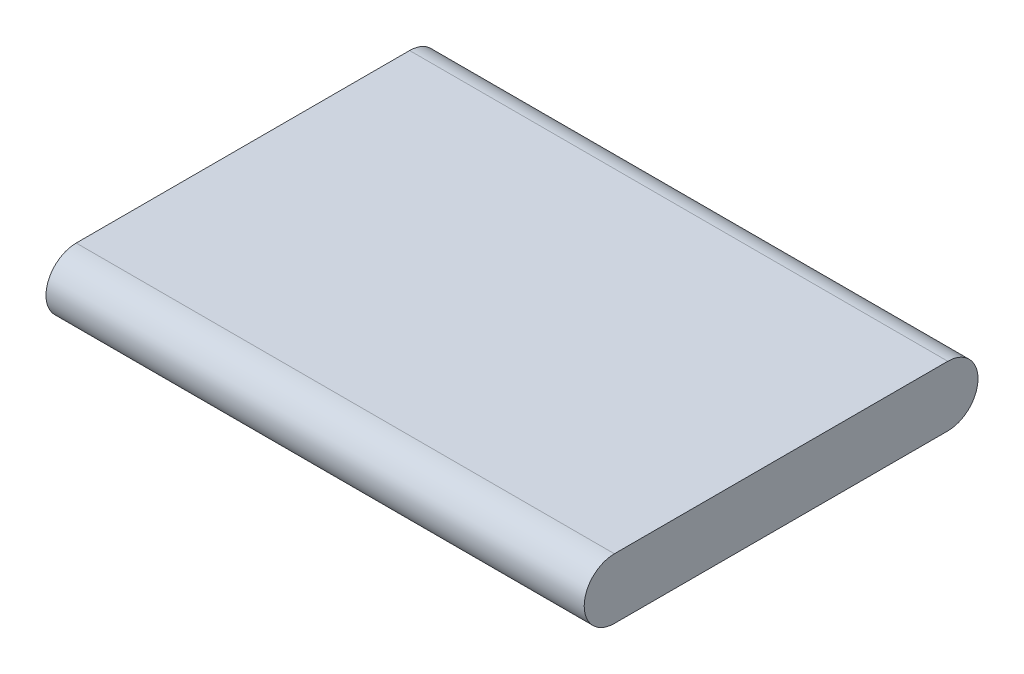
ISO-10303-21;
HEADER;
FILE_DESCRIPTION(('STEP AP214'),'2;1');
FILE_NAME('part.step','',(''),(''),'','','');
FILE_SCHEMA(('AUTOMOTIVE_DESIGN { 1 0 10303 214 1 1 1 1 }'));
ENDSEC;
DATA;
#1=APPLICATION_CONTEXT('core data for automotive mechanical design processes');
#2=APPLICATION_PROTOCOL_DEFINITION('international standard','automotive_design',2000,#1);
#3=PRODUCT_CONTEXT('',#1,'mechanical');
#4=PRODUCT('Part','Part','',(#3));
#5=PRODUCT_RELATED_PRODUCT_CATEGORY('part','',(#4));
#6=PRODUCT_DEFINITION_FORMATION('','',#4);
#7=PRODUCT_DEFINITION_CONTEXT('part definition',#1,'design');
#8=PRODUCT_DEFINITION('design','',#6,#7);
#9=PRODUCT_DEFINITION_SHAPE('','',#8);
#10=(LENGTH_UNIT() NAMED_UNIT(*) SI_UNIT(.MILLI.,.METRE.));
#11=(NAMED_UNIT(*) PLANE_ANGLE_UNIT() SI_UNIT($,.RADIAN.));
#12=(NAMED_UNIT(*) SI_UNIT($,.STERADIAN.) SOLID_ANGLE_UNIT());
#13=UNCERTAINTY_MEASURE_WITH_UNIT(LENGTH_MEASURE(1.E-05),#10,'distance_accuracy_value','');
#14=(GEOMETRIC_REPRESENTATION_CONTEXT(3) GLOBAL_UNCERTAINTY_ASSIGNED_CONTEXT((#13)) GLOBAL_UNIT_ASSIGNED_CONTEXT((#10,
#11,#12)) REPRESENTATION_CONTEXT('',''));
#15=CARTESIAN_POINT('',(0.,0.,0.));
#16=DIRECTION('',(0.,0.,1.));
#17=DIRECTION('',(1.,0.,0.));
#18=AXIS2_PLACEMENT_3D('',#15,#16,#17);
#19=CARTESIAN_POINT('',(41.,0.,10.8135444842036));
#20=DIRECTION('',(-1.,0.,0.));
#21=DIRECTION('',(0.,0.,1.));
#22=AXIS2_PLACEMENT_3D('',#19,#20,#21);
#23=CYLINDRICAL_SURFACE('',#22,2.3);
#24=CARTESIAN_POINT('',(0.,0.,10.8135444842036));
#25=DIRECTION('',(1.,0.,0.));
#26=DIRECTION('',(0.,0.,-1.));
#27=AXIS2_PLACEMENT_3D('',#24,#25,#26);
#28=CIRCLE('',#27,2.3);
#29=CARTESIAN_POINT('',(0.,2.3,10.8135444842036));
#30=VERTEX_POINT('',#29);
#31=CARTESIAN_POINT('',(0.,-2.3,10.8135444842036));
#32=VERTEX_POINT('',#31);
#33=EDGE_CURVE('E96',#30,#32,#28,.T.);
#34=ORIENTED_EDGE('',*,*,#33,.T.);
#35=DIRECTION('',(-1.,0.,0.));
#36=VECTOR('',#35,1.);
#37=CARTESIAN_POINT('',(41.,-2.3,10.8135444842036));
#38=LINE('',#37,#36);
#39=CARTESIAN_POINT('',(41.,-2.3,10.8135444842036));
#40=VERTEX_POINT('',#39);
#41=EDGE_CURVE('E11',#40,#32,#38,.T.);
#42=ORIENTED_EDGE('',*,*,#41,.F.);
#43=CARTESIAN_POINT('',(41.,0.,10.8135444842036));
#44=DIRECTION('',(1.,0.,0.));
#45=DIRECTION('',(0.,0.,-1.));
#46=AXIS2_PLACEMENT_3D('',#43,#44,#45);
#47=CIRCLE('',#46,2.3);
#48=CARTESIAN_POINT('',(41.,2.3,10.8135444842036));
#49=VERTEX_POINT('',#48);
#50=EDGE_CURVE('E84',#49,#40,#47,.T.);
#51=ORIENTED_EDGE('',*,*,#50,.F.);
#52=DIRECTION('',(-1.,0.,0.));
#53=VECTOR('',#52,1.);
#54=CARTESIAN_POINT('',(41.,2.3,10.8135444842036));
#55=LINE('',#54,#53);
#56=EDGE_CURVE('E92',#49,#30,#55,.T.);
#57=ORIENTED_EDGE('',*,*,#56,.T.);
#58=EDGE_LOOP('',(#34,#42,#51,#57));
#59=FACE_BOUND('',#58,.T.);
#60=ADVANCED_FACE('F33',(#59),#23,.T.);
#61=CARTESIAN_POINT('',(41.,-2.3,10.8135444842036));
#62=DIRECTION('',(0.,1.,0.));
#63=DIRECTION('',(0.,0.,1.));
#64=AXIS2_PLACEMENT_3D('',#61,#62,#63);
#65=PLANE('',#64);
#66=DIRECTION('',(0.,0.,-1.));
#67=VECTOR('',#66,1.);
#68=CARTESIAN_POINT('',(0.,-2.3,10.8135444842036));
#69=LINE('',#68,#67);
#70=CARTESIAN_POINT('',(0.,-2.3,-14.5864555157964));
#71=VERTEX_POINT('',#70);
#72=EDGE_CURVE('E88',#32,#71,#69,.T.);
#73=ORIENTED_EDGE('',*,*,#72,.T.);
#74=DIRECTION('',(-1.,0.,0.));
#75=VECTOR('',#74,1.);
#76=CARTESIAN_POINT('',(41.,-2.3,-14.5864555157964));
#77=LINE('',#76,#75);
#78=CARTESIAN_POINT('',(41.,-2.3,-14.5864555157964));
#79=VERTEX_POINT('',#78);
#80=EDGE_CURVE('E41',#79,#71,#77,.T.);
#81=ORIENTED_EDGE('',*,*,#80,.F.);
#82=DIRECTION('',(0.,0.,-1.));
#83=VECTOR('',#82,1.);
#84=CARTESIAN_POINT('',(41.,-2.3,10.8135444842036));
#85=LINE('',#84,#83);
#86=EDGE_CURVE('E79',#40,#79,#85,.T.);
#87=ORIENTED_EDGE('',*,*,#86,.F.);
#88=ORIENTED_EDGE('',*,*,#41,.T.);
#89=EDGE_LOOP('',(#73,#81,#87,#88));
#90=FACE_BOUND('',#89,.T.);
#91=ADVANCED_FACE('F87',(#90),#65,.F.);
#92=CARTESIAN_POINT('',(41.,0.,-14.5864555157964));
#93=DIRECTION('',(-1.,0.,0.));
#94=DIRECTION('',(0.,0.,1.));
#95=AXIS2_PLACEMENT_3D('',#92,#93,#94);
#96=CYLINDRICAL_SURFACE('',#95,2.3);
#97=CARTESIAN_POINT('',(0.,0.,-14.5864555157964));
#98=DIRECTION('',(1.,0.,0.));
#99=DIRECTION('',(0.,0.,-1.));
#100=AXIS2_PLACEMENT_3D('',#97,#98,#99);
#101=CIRCLE('',#100,2.3);
#102=CARTESIAN_POINT('',(0.,2.3,-14.5864555157964));
#103=VERTEX_POINT('',#102);
#104=EDGE_CURVE('E66',#71,#103,#101,.T.);
#105=ORIENTED_EDGE('',*,*,#104,.T.);
#106=DIRECTION('',(-1.,0.,0.));
#107=VECTOR('',#106,1.);
#108=CARTESIAN_POINT('',(41.,2.3,-14.5864555157964));
#109=LINE('',#108,#107);
#110=CARTESIAN_POINT('',(41.,2.3,-14.5864555157964));
#111=VERTEX_POINT('',#110);
#112=EDGE_CURVE('E89',#111,#103,#109,.T.);
#113=ORIENTED_EDGE('',*,*,#112,.F.);
#114=CARTESIAN_POINT('',(41.,0.,-14.5864555157964));
#115=DIRECTION('',(1.,0.,0.));
#116=DIRECTION('',(0.,0.,-1.));
#117=AXIS2_PLACEMENT_3D('',#114,#115,#116);
#118=CIRCLE('',#117,2.3);
#119=EDGE_CURVE('E82',#79,#111,#118,.T.);
#120=ORIENTED_EDGE('',*,*,#119,.F.);
#121=ORIENTED_EDGE('',*,*,#80,.T.);
#122=EDGE_LOOP('',(#105,#113,#120,#121));
#123=FACE_BOUND('',#122,.T.);
#124=ADVANCED_FACE('F90',(#123),#96,.T.);
#125=CARTESIAN_POINT('',(41.,2.3,10.8135444842036));
#126=DIRECTION('',(0.,-1.,0.));
#127=DIRECTION('',(0.,0.,-1.));
#128=AXIS2_PLACEMENT_3D('',#125,#126,#127);
#129=PLANE('',#128);
#130=DIRECTION('',(0.,0.,1.));
#131=VECTOR('',#130,1.);
#132=CARTESIAN_POINT('',(0.,2.3,10.8135444842036));
#133=LINE('',#132,#131);
#134=EDGE_CURVE('E72',#103,#30,#133,.T.);
#135=ORIENTED_EDGE('',*,*,#134,.T.);
#136=ORIENTED_EDGE('',*,*,#56,.F.);
#137=DIRECTION('',(0.,0.,1.));
#138=VECTOR('',#137,1.);
#139=CARTESIAN_POINT('',(41.,2.3,10.8135444842036));
#140=LINE('',#139,#138);
#141=EDGE_CURVE('E49',#111,#49,#140,.T.);
#142=ORIENTED_EDGE('',*,*,#141,.F.);
#143=ORIENTED_EDGE('',*,*,#112,.T.);
#144=EDGE_LOOP('',(#135,#136,#142,#143));
#145=FACE_BOUND('',#144,.T.);
#146=ADVANCED_FACE('F103',(#145),#129,.F.);
#147=CARTESIAN_POINT('',(41.,0.,10.8135444842036));
#148=DIRECTION('',(1.,0.,0.));
#149=DIRECTION('',(0.,0.,-1.));
#150=AXIS2_PLACEMENT_3D('',#147,#148,#149);
#151=PLANE('',#150);
#152=ORIENTED_EDGE('',*,*,#50,.T.);
#153=ORIENTED_EDGE('',*,*,#86,.T.);
#154=ORIENTED_EDGE('',*,*,#119,.T.);
#155=ORIENTED_EDGE('',*,*,#141,.T.);
#156=EDGE_LOOP('',(#152,#153,#154,#155));
#157=FACE_BOUND('',#156,.T.);
#158=ADVANCED_FACE('F80',(#157),#151,.T.);
#159=CARTESIAN_POINT('',(0.,0.,10.8135444842036));
#160=DIRECTION('',(1.,0.,0.));
#161=DIRECTION('',(0.,0.,-1.));
#162=AXIS2_PLACEMENT_3D('',#159,#160,#161);
#163=PLANE('',#162);
#164=ORIENTED_EDGE('',*,*,#33,.F.);
#165=ORIENTED_EDGE('',*,*,#134,.F.);
#166=ORIENTED_EDGE('',*,*,#104,.F.);
#167=ORIENTED_EDGE('',*,*,#72,.F.);
#168=EDGE_LOOP('',(#164,#165,#166,#167));
#169=FACE_BOUND('',#168,.T.);
#170=ADVANCED_FACE('F106',(#169),#163,.F.);
#171=CLOSED_SHELL('',(#60,#91,#124,#146,#158,#170));
#172=MANIFOLD_SOLID_BREP('B2',#171);
#173=ADVANCED_BREP_SHAPE_REPRESENTATION('',(#18,#172),#14);
#174=SHAPE_DEFINITION_REPRESENTATION(#9,#173);
ENDSEC;
END-ISO-10303-21;
